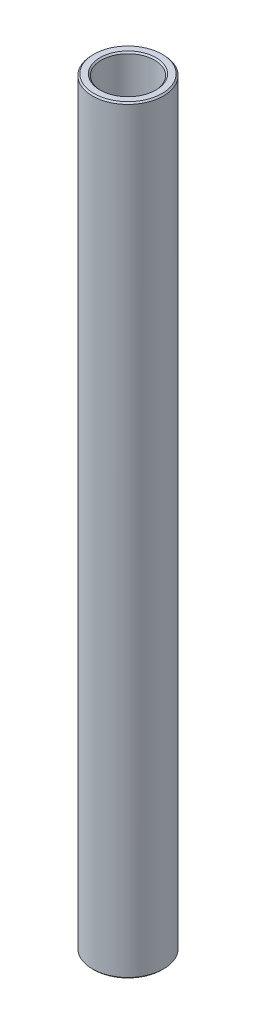
ISO-10303-21;
HEADER;
FILE_DESCRIPTION(('STEP AP214'),'2;1');
FILE_NAME('part.step','',(''),(''),'','','');
FILE_SCHEMA(('AUTOMOTIVE_DESIGN { 1 0 10303 214 1 1 1 1 }'));
ENDSEC;
DATA;
#1=APPLICATION_CONTEXT('core data for automotive mechanical design processes');
#2=APPLICATION_PROTOCOL_DEFINITION('international standard','automotive_design',2000,#1);
#3=PRODUCT_CONTEXT('',#1,'mechanical');
#4=PRODUCT('Part','Part','',(#3));
#5=PRODUCT_RELATED_PRODUCT_CATEGORY('part','',(#4));
#6=PRODUCT_DEFINITION_FORMATION('','',#4);
#7=PRODUCT_DEFINITION_CONTEXT('part definition',#1,'design');
#8=PRODUCT_DEFINITION('design','',#6,#7);
#9=PRODUCT_DEFINITION_SHAPE('','',#8);
#10=(LENGTH_UNIT() NAMED_UNIT(*) SI_UNIT(.MILLI.,.METRE.));
#11=(NAMED_UNIT(*) PLANE_ANGLE_UNIT() SI_UNIT($,.RADIAN.));
#12=(NAMED_UNIT(*) SI_UNIT($,.STERADIAN.) SOLID_ANGLE_UNIT());
#13=UNCERTAINTY_MEASURE_WITH_UNIT(LENGTH_MEASURE(1.E-05),#10,'distance_accuracy_value','');
#14=(GEOMETRIC_REPRESENTATION_CONTEXT(3) GLOBAL_UNCERTAINTY_ASSIGNED_CONTEXT((#13)) GLOBAL_UNIT_ASSIGNED_CONTEXT((#10,
#11,#12)) REPRESENTATION_CONTEXT('',''));
#15=CARTESIAN_POINT('',(0.,0.,0.));
#16=DIRECTION('',(0.,0.,1.));
#17=DIRECTION('',(1.,0.,0.));
#18=AXIS2_PLACEMENT_3D('',#15,#16,#17);
#19=CARTESIAN_POINT('',(0.,11.60859375,0.));
#20=DIRECTION('',(0.,1.,0.));
#21=DIRECTION('',(-1.,0.,0.));
#22=AXIS2_PLACEMENT_3D('',#19,#20,#21);
#23=CYLINDRICAL_SURFACE('',#22,4.7625);
#24=CARTESIAN_POINT('',(0.,-67.6043225,0.));
#25=DIRECTION('',(0.,1.,0.));
#26=DIRECTION('',(-1.,0.,0.));
#27=AXIS2_PLACEMENT_3D('',#24,#25,#26);
#28=CIRCLE('',#27,4.7625);
#29=CARTESIAN_POINT('',(-4.76250000000001,-67.6043225,0.));
#30=VERTEX_POINT('',#29);
#31=EDGE_CURVE('E50',#30,#30,#28,.F.);
#32=ORIENTED_EDGE('',*,*,#31,.T.);
#33=EDGE_LOOP('',(#32));
#34=FACE_BOUND('',#33,.T.);
#35=CARTESIAN_POINT('',(0.,67.6043225,0.));
#36=DIRECTION('',(0.,-1.,0.));
#37=DIRECTION('',(1.,0.,0.));
#38=AXIS2_PLACEMENT_3D('',#35,#36,#37);
#39=CIRCLE('',#38,4.7625);
#40=CARTESIAN_POINT('',(4.76250000000001,67.6043225,0.));
#41=VERTEX_POINT('',#40);
#42=EDGE_CURVE('E53',#41,#41,#39,.F.);
#43=ORIENTED_EDGE('',*,*,#42,.T.);
#44=EDGE_LOOP('',(#43));
#45=FACE_BOUND('',#44,.T.);
#46=ADVANCED_FACE('F30',(#34,#45),#23,.F.);
#47=CARTESIAN_POINT('',(4.76249999999999,67.8583225,0.));
#48=DIRECTION('',(0.,-1.,0.));
#49=DIRECTION('',(1.,0.,0.));
#50=AXIS2_PLACEMENT_3D('',#47,#48,#49);
#51=PLANE('',#50);
#52=CARTESIAN_POINT('',(0.,67.8583225,0.));
#53=DIRECTION('',(0.,-1.,0.));
#54=DIRECTION('',(1.,0.,0.));
#55=AXIS2_PLACEMENT_3D('',#52,#53,#54);
#56=CIRCLE('',#55,6.09599999999999);
#57=CARTESIAN_POINT('',(6.096,67.8583225,0.));
#58=VERTEX_POINT('',#57);
#59=EDGE_CURVE('E10',#58,#58,#56,.F.);
#60=ORIENTED_EDGE('',*,*,#59,.T.);
#61=EDGE_LOOP('',(#60));
#62=FACE_BOUND('',#61,.T.);
#63=CARTESIAN_POINT('',(0.,67.8583225,0.));
#64=DIRECTION('',(0.,-1.,0.));
#65=DIRECTION('',(1.,0.,0.));
#66=AXIS2_PLACEMENT_3D('',#63,#64,#65);
#67=CIRCLE('',#66,5.01649999999999);
#68=CARTESIAN_POINT('',(5.0165,67.8583225,0.));
#69=VERTEX_POINT('',#68);
#70=EDGE_CURVE('E37',#69,#69,#67,.T.);
#71=ORIENTED_EDGE('',*,*,#70,.T.);
#72=EDGE_LOOP('',(#71));
#73=FACE_BOUND('',#72,.T.);
#74=ADVANCED_FACE('F76',(#62,#73),#51,.F.);
#75=CARTESIAN_POINT('',(0.,11.60859375,0.));
#76=DIRECTION('',(0.,1.,0.));
#77=DIRECTION('',(-1.,0.,0.));
#78=AXIS2_PLACEMENT_3D('',#75,#76,#77);
#79=CYLINDRICAL_SURFACE('',#78,6.35);
#80=CARTESIAN_POINT('',(0.,-67.6043225,0.));
#81=DIRECTION('',(0.,1.,0.));
#82=DIRECTION('',(-1.,0.,0.));
#83=AXIS2_PLACEMENT_3D('',#80,#81,#82);
#84=CIRCLE('',#83,6.35);
#85=CARTESIAN_POINT('',(-6.35000000000001,-67.6043225,0.));
#86=VERTEX_POINT('',#85);
#87=EDGE_CURVE('E41',#86,#86,#84,.T.);
#88=ORIENTED_EDGE('',*,*,#87,.T.);
#89=EDGE_LOOP('',(#88));
#90=FACE_BOUND('',#89,.T.);
#91=CARTESIAN_POINT('',(0.,67.6043225,0.));
#92=DIRECTION('',(0.,-1.,0.));
#93=DIRECTION('',(1.,0.,0.));
#94=AXIS2_PLACEMENT_3D('',#91,#92,#93);
#95=CIRCLE('',#94,6.35);
#96=CARTESIAN_POINT('',(6.35000000000001,67.6043225,0.));
#97=VERTEX_POINT('',#96);
#98=EDGE_CURVE('E45',#97,#97,#95,.T.);
#99=ORIENTED_EDGE('',*,*,#98,.T.);
#100=EDGE_LOOP('',(#99));
#101=FACE_BOUND('',#100,.T.);
#102=ADVANCED_FACE('F73',(#90,#101),#79,.T.);
#103=CARTESIAN_POINT('',(6.35000000000001,-67.8583225,0.));
#104=DIRECTION('',(0.,1.,0.));
#105=DIRECTION('',(-1.,0.,0.));
#106=AXIS2_PLACEMENT_3D('',#103,#104,#105);
#107=PLANE('',#106);
#108=CARTESIAN_POINT('',(0.,-67.8583225,0.));
#109=DIRECTION('',(0.,1.,0.));
#110=DIRECTION('',(-1.,0.,0.));
#111=AXIS2_PLACEMENT_3D('',#108,#109,#110);
#112=CIRCLE('',#111,5.01650000000001);
#113=CARTESIAN_POINT('',(-5.01650000000001,-67.8583225,0.));
#114=VERTEX_POINT('',#113);
#115=EDGE_CURVE('E56',#114,#114,#112,.T.);
#116=ORIENTED_EDGE('',*,*,#115,.T.);
#117=EDGE_LOOP('',(#116));
#118=FACE_BOUND('',#117,.T.);
#119=CARTESIAN_POINT('',(0.,-67.8583225,0.));
#120=DIRECTION('',(0.,1.,0.));
#121=DIRECTION('',(-1.,0.,0.));
#122=AXIS2_PLACEMENT_3D('',#119,#120,#121);
#123=CIRCLE('',#122,6.09599999999998);
#124=CARTESIAN_POINT('',(-6.09599999999998,-67.8583225,0.));
#125=VERTEX_POINT('',#124);
#126=EDGE_CURVE('E59',#125,#125,#123,.F.);
#127=ORIENTED_EDGE('',*,*,#126,.T.);
#128=EDGE_LOOP('',(#127));
#129=FACE_BOUND('',#128,.T.);
#130=ADVANCED_FACE('F63',(#118,#129),#107,.F.);
#131=CARTESIAN_POINT('',(0.,-67.8583225,0.));
#132=DIRECTION('',(0.,-1.,0.));
#133=DIRECTION('',(1.,0.,0.));
#134=AXIS2_PLACEMENT_3D('',#131,#132,#133);
#135=CONICAL_SURFACE('',#134,5.01650000000001,0.785398163397453);
#136=ORIENTED_EDGE('',*,*,#31,.F.);
#137=EDGE_LOOP('',(#136));
#138=FACE_BOUND('',#137,.T.);
#139=ORIENTED_EDGE('',*,*,#115,.F.);
#140=EDGE_LOOP('',(#139));
#141=FACE_BOUND('',#140,.T.);
#142=ADVANCED_FACE('F69',(#138,#141),#135,.F.);
#143=CARTESIAN_POINT('',(0.,-67.6043225,0.));
#144=DIRECTION('',(0.,1.,0.));
#145=DIRECTION('',(-1.,0.,0.));
#146=AXIS2_PLACEMENT_3D('',#143,#144,#145);
#147=CONICAL_SURFACE('',#146,6.35,0.785398163397462);
#148=ORIENTED_EDGE('',*,*,#126,.F.);
#149=EDGE_LOOP('',(#148));
#150=FACE_BOUND('',#149,.T.);
#151=ORIENTED_EDGE('',*,*,#87,.F.);
#152=EDGE_LOOP('',(#151));
#153=FACE_BOUND('',#152,.T.);
#154=ADVANCED_FACE('F65',(#150,#153),#147,.T.);
#155=CARTESIAN_POINT('',(0.,67.8583225,0.));
#156=DIRECTION('',(0.,-1.,0.));
#157=DIRECTION('',(1.,0.,0.));
#158=AXIS2_PLACEMENT_3D('',#155,#156,#157);
#159=CONICAL_SURFACE('',#158,6.09599999999999,0.785398163397462);
#160=ORIENTED_EDGE('',*,*,#98,.F.);
#161=EDGE_LOOP('',(#160));
#162=FACE_BOUND('',#161,.T.);
#163=ORIENTED_EDGE('',*,*,#59,.F.);
#164=EDGE_LOOP('',(#163));
#165=FACE_BOUND('',#164,.T.);
#166=ADVANCED_FACE('F68',(#162,#165),#159,.T.);
#167=CARTESIAN_POINT('',(0.,67.6043225,0.));
#168=DIRECTION('',(0.,1.,0.));
#169=DIRECTION('',(-1.,0.,0.));
#170=AXIS2_PLACEMENT_3D('',#167,#168,#169);
#171=CONICAL_SURFACE('',#170,4.7625,0.785398163397426);
#172=ORIENTED_EDGE('',*,*,#70,.F.);
#173=EDGE_LOOP('',(#172));
#174=FACE_BOUND('',#173,.T.);
#175=ORIENTED_EDGE('',*,*,#42,.F.);
#176=EDGE_LOOP('',(#175));
#177=FACE_BOUND('',#176,.T.);
#178=ADVANCED_FACE('F32',(#174,#177),#171,.F.);
#179=CLOSED_SHELL('',(#46,#74,#102,#130,#142,#154,#166,#178));
#180=MANIFOLD_SOLID_BREP('B2',#179);
#181=ADVANCED_BREP_SHAPE_REPRESENTATION('',(#18,#180),#14);
#182=SHAPE_DEFINITION_REPRESENTATION(#9,#181);
ENDSEC;
END-ISO-10303-21;
